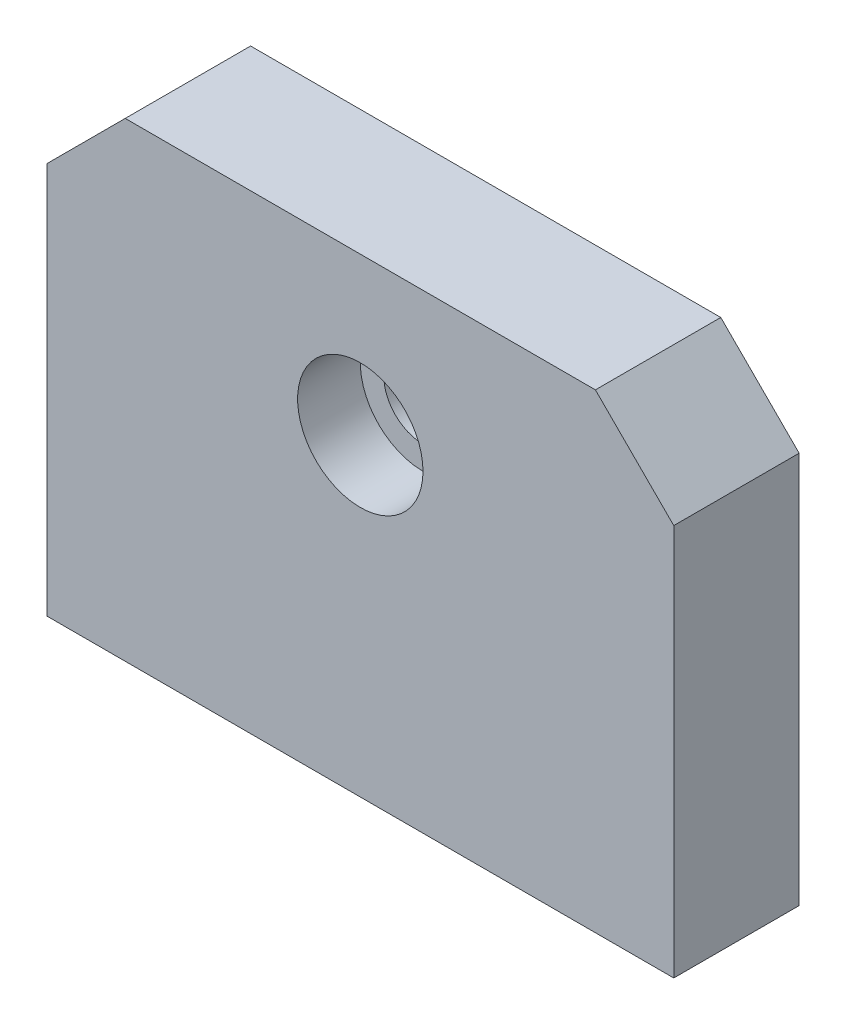
ISO-10303-21;
HEADER;
FILE_DESCRIPTION(('STEP AP214'),'2;1');
FILE_NAME('part.step','',(''),(''),'','','');
FILE_SCHEMA(('AUTOMOTIVE_DESIGN { 1 0 10303 214 1 1 1 1 }'));
ENDSEC;
DATA;
#1=APPLICATION_CONTEXT('core data for automotive mechanical design processes');
#2=APPLICATION_PROTOCOL_DEFINITION('international standard','automotive_design',2000,#1);
#3=PRODUCT_CONTEXT('',#1,'mechanical');
#4=PRODUCT('Part','Part','',(#3));
#5=PRODUCT_RELATED_PRODUCT_CATEGORY('part','',(#4));
#6=PRODUCT_DEFINITION_FORMATION('','',#4);
#7=PRODUCT_DEFINITION_CONTEXT('part definition',#1,'design');
#8=PRODUCT_DEFINITION('design','',#6,#7);
#9=PRODUCT_DEFINITION_SHAPE('','',#8);
#10=(LENGTH_UNIT() NAMED_UNIT(*) SI_UNIT(.MILLI.,.METRE.));
#11=(NAMED_UNIT(*) PLANE_ANGLE_UNIT() SI_UNIT($,.RADIAN.));
#12=(NAMED_UNIT(*) SI_UNIT($,.STERADIAN.) SOLID_ANGLE_UNIT());
#13=UNCERTAINTY_MEASURE_WITH_UNIT(LENGTH_MEASURE(1.E-05),#10,'distance_accuracy_value','');
#14=(GEOMETRIC_REPRESENTATION_CONTEXT(3) GLOBAL_UNCERTAINTY_ASSIGNED_CONTEXT((#13)) GLOBAL_UNIT_ASSIGNED_CONTEXT((#10,
#11,#12)) REPRESENTATION_CONTEXT('',''));
#15=CARTESIAN_POINT('',(0.,0.,0.));
#16=DIRECTION('',(0.,0.,1.));
#17=DIRECTION('',(1.,0.,0.));
#18=AXIS2_PLACEMENT_3D('',#15,#16,#17);
#19=CARTESIAN_POINT('',(0.,0.,8.));
#20=DIRECTION('',(0.,0.,-1.));
#21=DIRECTION('',(-1.,0.,0.));
#22=AXIS2_PLACEMENT_3D('',#19,#20,#21);
#23=CYLINDRICAL_SURFACE('',#22,2.5);
#24=CARTESIAN_POINT('',(0.,0.,0.));
#25=DIRECTION('',(0.,0.,1.));
#26=DIRECTION('',(1.,0.,0.));
#27=AXIS2_PLACEMENT_3D('',#24,#25,#26);
#28=CIRCLE('',#27,2.5);
#29=CARTESIAN_POINT('',(2.5,0.,0.));
#30=VERTEX_POINT('',#29);
#31=EDGE_CURVE('E121',#30,#30,#28,.T.);
#32=ORIENTED_EDGE('',*,*,#31,.F.);
#33=EDGE_LOOP('',(#32));
#34=FACE_BOUND('',#33,.T.);
#35=CARTESIAN_POINT('',(0.,0.,4.));
#36=DIRECTION('',(0.,0.,1.));
#37=DIRECTION('',(1.,0.,0.));
#38=AXIS2_PLACEMENT_3D('',#35,#36,#37);
#39=CIRCLE('',#38,2.5);
#40=CARTESIAN_POINT('',(2.5,0.,4.));
#41=VERTEX_POINT('',#40);
#42=EDGE_CURVE('E35',#41,#41,#39,.T.);
#43=ORIENTED_EDGE('',*,*,#42,.T.);
#44=EDGE_LOOP('',(#43));
#45=FACE_BOUND('',#44,.T.);
#46=ADVANCED_FACE('F31',(#34,#45),#23,.F.);
#47=CARTESIAN_POINT('',(0.,25.,8.));
#48=DIRECTION('',(0.,0.,-1.));
#49=DIRECTION('',(-1.,0.,0.));
#50=AXIS2_PLACEMENT_3D('',#47,#48,#49);
#51=PLANE('',#50);
#52=CARTESIAN_POINT('',(0.,0.,8.));
#53=DIRECTION('',(0.,0.,1.));
#54=DIRECTION('',(1.,0.,0.));
#55=AXIS2_PLACEMENT_3D('',#52,#53,#54);
#56=CIRCLE('',#55,4.);
#57=CARTESIAN_POINT('',(4.,0.,8.));
#58=VERTEX_POINT('',#57);
#59=EDGE_CURVE('E249',#58,#58,#56,.T.);
#60=ORIENTED_EDGE('',*,*,#59,.F.);
#61=EDGE_LOOP('',(#60));
#62=FACE_BOUND('',#61,.T.);
#63=DIRECTION('',(-0.707106781186548,0.707106781186547,0.));
#64=VECTOR('',#63,1.);
#65=CARTESIAN_POINT('',(20.,5.,8.));
#66=LINE('',#65,#64);
#67=CARTESIAN_POINT('',(20.,5.,8.));
#68=VERTEX_POINT('',#67);
#69=CARTESIAN_POINT('',(15.,10.,8.));
#70=VERTEX_POINT('',#69);
#71=EDGE_CURVE('E128',#68,#70,#66,.T.);
#72=ORIENTED_EDGE('',*,*,#71,.T.);
#73=DIRECTION('',(-1.,0.,0.));
#74=VECTOR('',#73,1.);
#75=CARTESIAN_POINT('',(-15.,10.,8.));
#76=LINE('',#75,#74);
#77=CARTESIAN_POINT('',(-15.,10.,8.));
#78=VERTEX_POINT('',#77);
#79=EDGE_CURVE('E86',#70,#78,#76,.T.);
#80=ORIENTED_EDGE('',*,*,#79,.T.);
#81=DIRECTION('',(-0.707106781186548,-0.707106781186548,0.));
#82=VECTOR('',#81,1.);
#83=CARTESIAN_POINT('',(-20.,5.,8.));
#84=LINE('',#83,#82);
#85=CARTESIAN_POINT('',(-20.,5.,8.));
#86=VERTEX_POINT('',#85);
#87=EDGE_CURVE('E99',#78,#86,#84,.T.);
#88=ORIENTED_EDGE('',*,*,#87,.T.);
#89=DIRECTION('',(0.,-1.,0.));
#90=VECTOR('',#89,1.);
#91=CARTESIAN_POINT('',(-20.,-20.,8.));
#92=LINE('',#91,#90);
#93=CARTESIAN_POINT('',(-20.,-20.,8.));
#94=VERTEX_POINT('',#93);
#95=EDGE_CURVE('E93',#86,#94,#92,.T.);
#96=ORIENTED_EDGE('',*,*,#95,.T.);
#97=DIRECTION('',(1.,0.,0.));
#98=VECTOR('',#97,1.);
#99=CARTESIAN_POINT('',(20.,-20.,8.));
#100=LINE('',#99,#98);
#101=CARTESIAN_POINT('',(20.,-20.,8.));
#102=VERTEX_POINT('',#101);
#103=EDGE_CURVE('E97',#94,#102,#100,.T.);
#104=ORIENTED_EDGE('',*,*,#103,.T.);
#105=DIRECTION('',(0.,1.,0.));
#106=VECTOR('',#105,1.);
#107=CARTESIAN_POINT('',(20.,5.,8.));
#108=LINE('',#107,#106);
#109=EDGE_CURVE('E49',#102,#68,#108,.T.);
#110=ORIENTED_EDGE('',*,*,#109,.T.);
#111=EDGE_LOOP('',(#72,#80,#88,#96,#104,#110));
#112=FACE_BOUND('',#111,.T.);
#113=ADVANCED_FACE('F95',(#62,#112),#51,.F.);
#114=CARTESIAN_POINT('',(0.,25.,0.));
#115=DIRECTION('',(0.,0.,-1.));
#116=DIRECTION('',(-1.,0.,0.));
#117=AXIS2_PLACEMENT_3D('',#114,#115,#116);
#118=PLANE('',#117);
#119=DIRECTION('',(-0.707106781186548,0.707106781186547,0.));
#120=VECTOR('',#119,1.);
#121=CARTESIAN_POINT('',(20.,5.,0.));
#122=LINE('',#121,#120);
#123=CARTESIAN_POINT('',(20.,5.,0.));
#124=VERTEX_POINT('',#123);
#125=CARTESIAN_POINT('',(15.,10.,0.));
#126=VERTEX_POINT('',#125);
#127=EDGE_CURVE('E117',#124,#126,#122,.T.);
#128=ORIENTED_EDGE('',*,*,#127,.F.);
#129=DIRECTION('',(0.,1.,0.));
#130=VECTOR('',#129,1.);
#131=CARTESIAN_POINT('',(20.,5.,0.));
#132=LINE('',#131,#130);
#133=CARTESIAN_POINT('',(20.,-20.,0.));
#134=VERTEX_POINT('',#133);
#135=EDGE_CURVE('E78',#134,#124,#132,.T.);
#136=ORIENTED_EDGE('',*,*,#135,.F.);
#137=DIRECTION('',(1.,0.,0.));
#138=VECTOR('',#137,1.);
#139=CARTESIAN_POINT('',(20.,-20.,0.));
#140=LINE('',#139,#138);
#141=CARTESIAN_POINT('',(-20.,-20.,0.));
#142=VERTEX_POINT('',#141);
#143=EDGE_CURVE('E72',#142,#134,#140,.T.);
#144=ORIENTED_EDGE('',*,*,#143,.F.);
#145=DIRECTION('',(0.,-1.,0.));
#146=VECTOR('',#145,1.);
#147=CARTESIAN_POINT('',(-20.,-20.,0.));
#148=LINE('',#147,#146);
#149=CARTESIAN_POINT('',(-20.,5.,0.));
#150=VERTEX_POINT('',#149);
#151=EDGE_CURVE('E107',#150,#142,#148,.T.);
#152=ORIENTED_EDGE('',*,*,#151,.F.);
#153=DIRECTION('',(-0.707106781186548,-0.707106781186548,0.));
#154=VECTOR('',#153,1.);
#155=CARTESIAN_POINT('',(-20.,5.,0.));
#156=LINE('',#155,#154);
#157=CARTESIAN_POINT('',(-15.,10.,0.));
#158=VERTEX_POINT('',#157);
#159=EDGE_CURVE('E123',#158,#150,#156,.T.);
#160=ORIENTED_EDGE('',*,*,#159,.F.);
#161=DIRECTION('',(-1.,0.,0.));
#162=VECTOR('',#161,1.);
#163=CARTESIAN_POINT('',(-15.,10.,0.));
#164=LINE('',#163,#162);
#165=EDGE_CURVE('E120',#126,#158,#164,.T.);
#166=ORIENTED_EDGE('',*,*,#165,.F.);
#167=EDGE_LOOP('',(#128,#136,#144,#152,#160,#166));
#168=FACE_BOUND('',#167,.T.);
#169=ORIENTED_EDGE('',*,*,#31,.T.);
#170=EDGE_LOOP('',(#169));
#171=FACE_BOUND('',#170,.T.);
#172=ADVANCED_FACE('F138',(#168,#171),#118,.T.);
#173=CARTESIAN_POINT('',(20.,5.,8.));
#174=DIRECTION('',(-0.707106781186547,-0.707106781186548,0.));
#175=DIRECTION('',(0.707106781186548,-0.707106781186547,0.));
#176=AXIS2_PLACEMENT_3D('',#173,#174,#175);
#177=PLANE('',#176);
#178=ORIENTED_EDGE('',*,*,#127,.T.);
#179=DIRECTION('',(0.,0.,-1.));
#180=VECTOR('',#179,1.);
#181=CARTESIAN_POINT('',(15.,10.,8.));
#182=LINE('',#181,#180);
#183=EDGE_CURVE('E11',#70,#126,#182,.T.);
#184=ORIENTED_EDGE('',*,*,#183,.F.);
#185=ORIENTED_EDGE('',*,*,#71,.F.);
#186=DIRECTION('',(0.,0.,-1.));
#187=VECTOR('',#186,1.);
#188=CARTESIAN_POINT('',(20.,5.,8.));
#189=LINE('',#188,#187);
#190=EDGE_CURVE('E113',#68,#124,#189,.T.);
#191=ORIENTED_EDGE('',*,*,#190,.T.);
#192=EDGE_LOOP('',(#178,#184,#185,#191));
#193=FACE_BOUND('',#192,.T.);
#194=ADVANCED_FACE('F33',(#193),#177,.F.);
#195=CARTESIAN_POINT('',(-15.,10.,8.));
#196=DIRECTION('',(0.,-1.,0.));
#197=DIRECTION('',(1.,0.,0.));
#198=AXIS2_PLACEMENT_3D('',#195,#196,#197);
#199=PLANE('',#198);
#200=ORIENTED_EDGE('',*,*,#165,.T.);
#201=DIRECTION('',(0.,0.,-1.));
#202=VECTOR('',#201,1.);
#203=CARTESIAN_POINT('',(-15.,10.,8.));
#204=LINE('',#203,#202);
#205=EDGE_CURVE('E41',#78,#158,#204,.T.);
#206=ORIENTED_EDGE('',*,*,#205,.F.);
#207=ORIENTED_EDGE('',*,*,#79,.F.);
#208=ORIENTED_EDGE('',*,*,#183,.T.);
#209=EDGE_LOOP('',(#200,#206,#207,#208));
#210=FACE_BOUND('',#209,.T.);
#211=ADVANCED_FACE('F172',(#210),#199,.F.);
#212=CARTESIAN_POINT('',(-20.,5.,8.));
#213=DIRECTION('',(0.707106781186547,-0.707106781186547,0.));
#214=DIRECTION('',(0.707106781186548,0.707106781186548,0.));
#215=AXIS2_PLACEMENT_3D('',#212,#213,#214);
#216=PLANE('',#215);
#217=ORIENTED_EDGE('',*,*,#159,.T.);
#218=DIRECTION('',(0.,0.,-1.));
#219=VECTOR('',#218,1.);
#220=CARTESIAN_POINT('',(-20.,5.,8.));
#221=LINE('',#220,#219);
#222=EDGE_CURVE('E108',#86,#150,#221,.T.);
#223=ORIENTED_EDGE('',*,*,#222,.F.);
#224=ORIENTED_EDGE('',*,*,#87,.F.);
#225=ORIENTED_EDGE('',*,*,#205,.T.);
#226=EDGE_LOOP('',(#217,#223,#224,#225));
#227=FACE_BOUND('',#226,.T.);
#228=ADVANCED_FACE('F135',(#227),#216,.F.);
#229=CARTESIAN_POINT('',(-20.,-20.,8.));
#230=DIRECTION('',(1.,0.,0.));
#231=DIRECTION('',(0.,0.,-1.));
#232=AXIS2_PLACEMENT_3D('',#229,#230,#231);
#233=PLANE('',#232);
#234=ORIENTED_EDGE('',*,*,#151,.T.);
#235=DIRECTION('',(0.,0.,-1.));
#236=VECTOR('',#235,1.);
#237=CARTESIAN_POINT('',(-20.,-20.,8.));
#238=LINE('',#237,#236);
#239=EDGE_CURVE('E104',#94,#142,#238,.T.);
#240=ORIENTED_EDGE('',*,*,#239,.F.);
#241=ORIENTED_EDGE('',*,*,#95,.F.);
#242=ORIENTED_EDGE('',*,*,#222,.T.);
#243=EDGE_LOOP('',(#234,#240,#241,#242));
#244=FACE_BOUND('',#243,.T.);
#245=ADVANCED_FACE('F105',(#244),#233,.F.);
#246=CARTESIAN_POINT('',(20.,-20.,8.));
#247=DIRECTION('',(0.,1.,0.));
#248=DIRECTION('',(-1.,0.,0.));
#249=AXIS2_PLACEMENT_3D('',#246,#247,#248);
#250=PLANE('',#249);
#251=CARTESIAN_POINT('',(15.5,-20.,4.));
#252=DIRECTION('',(0.,-1.,0.));
#253=DIRECTION('',(1.,0.,0.));
#254=AXIS2_PLACEMENT_3D('',#251,#252,#253);
#255=CIRCLE('',#254,2.);
#256=CARTESIAN_POINT('',(17.5,-20.,4.));
#257=VERTEX_POINT('',#256);
#258=EDGE_CURVE('E265',#257,#257,#255,.T.);
#259=ORIENTED_EDGE('',*,*,#258,.F.);
#260=EDGE_LOOP('',(#259));
#261=FACE_BOUND('',#260,.T.);
#262=CARTESIAN_POINT('',(-15.5,-20.,4.));
#263=DIRECTION('',(0.,-1.,0.));
#264=DIRECTION('',(1.,0.,0.));
#265=AXIS2_PLACEMENT_3D('',#262,#263,#264);
#266=CIRCLE('',#265,2.);
#267=CARTESIAN_POINT('',(-13.5,-20.,4.));
#268=VERTEX_POINT('',#267);
#269=EDGE_CURVE('E255',#268,#268,#266,.T.);
#270=ORIENTED_EDGE('',*,*,#269,.F.);
#271=EDGE_LOOP('',(#270));
#272=FACE_BOUND('',#271,.T.);
#273=ORIENTED_EDGE('',*,*,#143,.T.);
#274=DIRECTION('',(0.,0.,-1.));
#275=VECTOR('',#274,1.);
#276=CARTESIAN_POINT('',(20.,-20.,8.));
#277=LINE('',#276,#275);
#278=EDGE_CURVE('E109',#102,#134,#277,.T.);
#279=ORIENTED_EDGE('',*,*,#278,.F.);
#280=ORIENTED_EDGE('',*,*,#103,.F.);
#281=ORIENTED_EDGE('',*,*,#239,.T.);
#282=EDGE_LOOP('',(#273,#279,#280,#281));
#283=FACE_BOUND('',#282,.T.);
#284=ADVANCED_FACE('F111',(#261,#272,#283),#250,.F.);
#285=CARTESIAN_POINT('',(20.,5.,8.));
#286=DIRECTION('',(-1.,0.,0.));
#287=DIRECTION('',(0.,-1.,0.));
#288=AXIS2_PLACEMENT_3D('',#285,#286,#287);
#289=PLANE('',#288);
#290=ORIENTED_EDGE('',*,*,#135,.T.);
#291=ORIENTED_EDGE('',*,*,#190,.F.);
#292=ORIENTED_EDGE('',*,*,#109,.F.);
#293=ORIENTED_EDGE('',*,*,#278,.T.);
#294=EDGE_LOOP('',(#290,#291,#292,#293));
#295=FACE_BOUND('',#294,.T.);
#296=ADVANCED_FACE('F143',(#295),#289,.F.);
#297=CARTESIAN_POINT('',(0.,0.,4.));
#298=DIRECTION('',(0.,0.,1.));
#299=DIRECTION('',(1.,0.,0.));
#300=AXIS2_PLACEMENT_3D('',#297,#298,#299);
#301=CYLINDRICAL_SURFACE('',#300,4.);
#302=CARTESIAN_POINT('',(0.,0.,4.));
#303=DIRECTION('',(0.,0.,1.));
#304=DIRECTION('',(1.,0.,0.));
#305=AXIS2_PLACEMENT_3D('',#302,#303,#304);
#306=CIRCLE('',#305,4.);
#307=CARTESIAN_POINT('',(4.,0.,4.));
#308=VERTEX_POINT('',#307);
#309=EDGE_CURVE('E248',#308,#308,#306,.T.);
#310=ORIENTED_EDGE('',*,*,#309,.F.);
#311=EDGE_LOOP('',(#310));
#312=FACE_BOUND('',#311,.T.);
#313=ORIENTED_EDGE('',*,*,#59,.T.);
#314=EDGE_LOOP('',(#313));
#315=FACE_BOUND('',#314,.T.);
#316=ADVANCED_FACE('F145',(#312,#315),#301,.F.);
#317=CARTESIAN_POINT('',(0.,0.,4.));
#318=DIRECTION('',(0.,0.,1.));
#319=DIRECTION('',(1.,0.,0.));
#320=AXIS2_PLACEMENT_3D('',#317,#318,#319);
#321=PLANE('',#320);
#322=ORIENTED_EDGE('',*,*,#42,.F.);
#323=EDGE_LOOP('',(#322));
#324=FACE_BOUND('',#323,.T.);
#325=ORIENTED_EDGE('',*,*,#309,.T.);
#326=EDGE_LOOP('',(#325));
#327=FACE_BOUND('',#326,.T.);
#328=ADVANCED_FACE('F151',(#324,#327),#321,.T.);
#329=CARTESIAN_POINT('',(-15.5,-5.,4.));
#330=DIRECTION('',(0.,-1.,0.));
#331=DIRECTION('',(1.,0.,0.));
#332=AXIS2_PLACEMENT_3D('',#329,#330,#331);
#333=CYLINDRICAL_SURFACE('',#332,2.);
#334=CARTESIAN_POINT('',(-15.5,-5.,4.));
#335=DIRECTION('',(0.,-1.,0.));
#336=DIRECTION('',(1.,0.,0.));
#337=AXIS2_PLACEMENT_3D('',#334,#335,#336);
#338=CIRCLE('',#337,2.);
#339=CARTESIAN_POINT('',(-13.5,-5.,4.));
#340=VERTEX_POINT('',#339);
#341=EDGE_CURVE('E252',#340,#340,#338,.T.);
#342=ORIENTED_EDGE('',*,*,#341,.F.);
#343=EDGE_LOOP('',(#342));
#344=FACE_BOUND('',#343,.T.);
#345=ORIENTED_EDGE('',*,*,#269,.T.);
#346=EDGE_LOOP('',(#345));
#347=FACE_BOUND('',#346,.T.);
#348=ADVANCED_FACE('F201',(#344,#347),#333,.F.);
#349=CARTESIAN_POINT('',(-15.5,-5.,4.));
#350=DIRECTION('',(0.,-1.,0.));
#351=DIRECTION('',(1.,0.,0.));
#352=AXIS2_PLACEMENT_3D('',#349,#350,#351);
#353=PLANE('',#352);
#354=ORIENTED_EDGE('',*,*,#341,.T.);
#355=EDGE_LOOP('',(#354));
#356=FACE_BOUND('',#355,.T.);
#357=ADVANCED_FACE('F206',(#356),#353,.T.);
#358=CARTESIAN_POINT('',(15.5,-5.,4.));
#359=DIRECTION('',(0.,-1.,0.));
#360=DIRECTION('',(1.,0.,0.));
#361=AXIS2_PLACEMENT_3D('',#358,#359,#360);
#362=CYLINDRICAL_SURFACE('',#361,2.);
#363=CARTESIAN_POINT('',(15.5,-5.,4.));
#364=DIRECTION('',(0.,-1.,0.));
#365=DIRECTION('',(1.,0.,0.));
#366=AXIS2_PLACEMENT_3D('',#363,#364,#365);
#367=CIRCLE('',#366,2.);
#368=CARTESIAN_POINT('',(17.5,-5.,4.));
#369=VERTEX_POINT('',#368);
#370=EDGE_CURVE('E262',#369,#369,#367,.T.);
#371=ORIENTED_EDGE('',*,*,#370,.F.);
#372=EDGE_LOOP('',(#371));
#373=FACE_BOUND('',#372,.T.);
#374=ORIENTED_EDGE('',*,*,#258,.T.);
#375=EDGE_LOOP('',(#374));
#376=FACE_BOUND('',#375,.T.);
#377=ADVANCED_FACE('F216',(#373,#376),#362,.F.);
#378=CARTESIAN_POINT('',(15.5,-5.,4.));
#379=DIRECTION('',(0.,-1.,0.));
#380=DIRECTION('',(1.,0.,0.));
#381=AXIS2_PLACEMENT_3D('',#378,#379,#380);
#382=PLANE('',#381);
#383=ORIENTED_EDGE('',*,*,#370,.T.);
#384=EDGE_LOOP('',(#383));
#385=FACE_BOUND('',#384,.T.);
#386=ADVANCED_FACE('F226',(#385),#382,.T.);
#387=CLOSED_SHELL('',(#46,#113,#172,#194,#211,#228,#245,#284,#296,#316,#328,#348,#357,#377,#386));
#388=MANIFOLD_SOLID_BREP('B2',#387);
#389=ADVANCED_BREP_SHAPE_REPRESENTATION('',(#18,#388),#14);
#390=SHAPE_DEFINITION_REPRESENTATION(#9,#389);
ENDSEC;
END-ISO-10303-21;
